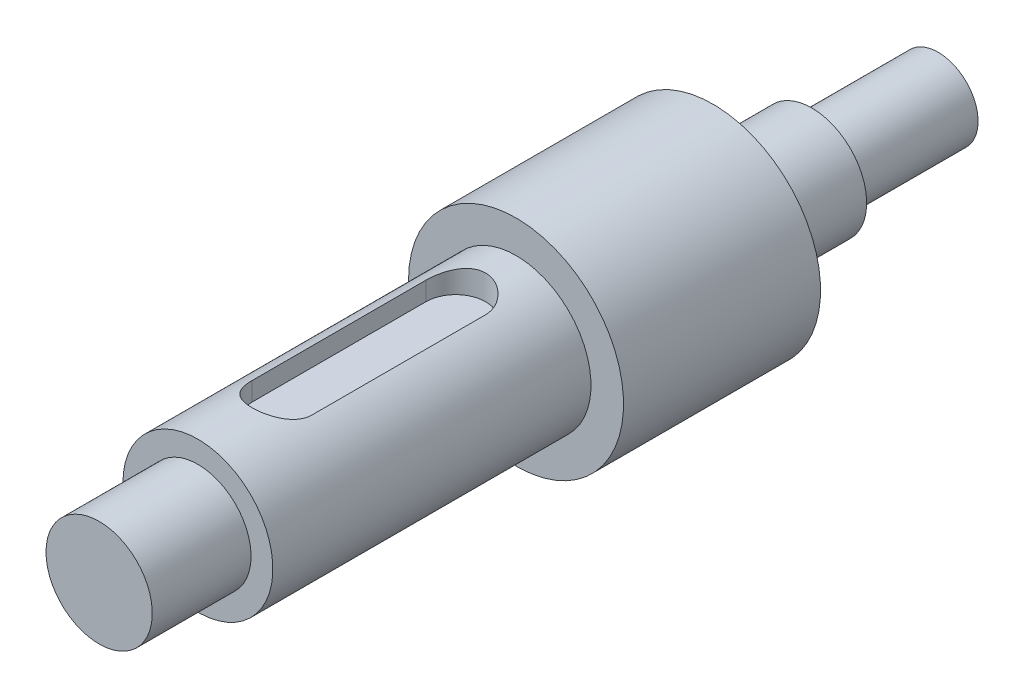
ISO-10303-21;
HEADER;
FILE_DESCRIPTION(('STEP AP214'),'2;1');
FILE_NAME('part.step','',(''),(''),'','','');
FILE_SCHEMA(('AUTOMOTIVE_DESIGN { 1 0 10303 214 1 1 1 1 }'));
ENDSEC;
DATA;
#1=APPLICATION_CONTEXT('core data for automotive mechanical design processes');
#2=APPLICATION_PROTOCOL_DEFINITION('international standard','automotive_design',2000,#1);
#3=PRODUCT_CONTEXT('',#1,'mechanical');
#4=PRODUCT('Part','Part','',(#3));
#5=PRODUCT_RELATED_PRODUCT_CATEGORY('part','',(#4));
#6=PRODUCT_DEFINITION_FORMATION('','',#4);
#7=PRODUCT_DEFINITION_CONTEXT('part definition',#1,'design');
#8=PRODUCT_DEFINITION('design','',#6,#7);
#9=PRODUCT_DEFINITION_SHAPE('','',#8);
#10=(LENGTH_UNIT() NAMED_UNIT(*) SI_UNIT(.MILLI.,.METRE.));
#11=(NAMED_UNIT(*) PLANE_ANGLE_UNIT() SI_UNIT($,.RADIAN.));
#12=(NAMED_UNIT(*) SI_UNIT($,.STERADIAN.) SOLID_ANGLE_UNIT());
#13=UNCERTAINTY_MEASURE_WITH_UNIT(LENGTH_MEASURE(1.E-05),#10,'distance_accuracy_value','');
#14=(GEOMETRIC_REPRESENTATION_CONTEXT(3) GLOBAL_UNCERTAINTY_ASSIGNED_CONTEXT((#13)) GLOBAL_UNIT_ASSIGNED_CONTEXT((#10,
#11,#12)) REPRESENTATION_CONTEXT('',''));
#15=CARTESIAN_POINT('',(0.,0.,0.));
#16=DIRECTION('',(0.,0.,1.));
#17=DIRECTION('',(1.,0.,0.));
#18=AXIS2_PLACEMENT_3D('',#15,#16,#17);
#19=CARTESIAN_POINT('',(0.318441737192823,0.,12.7486249221533));
#20=DIRECTION('',(0.,0.,-1.));
#21=DIRECTION('',(-1.,0.,0.));
#22=AXIS2_PLACEMENT_3D('',#19,#20,#21);
#23=CYLINDRICAL_SURFACE('',#22,15.0366592187236);
#24=CARTESIAN_POINT('',(0.318441737192834,0.,97.4337251720174));
#25=DIRECTION('',(0.,0.,-1.));
#26=DIRECTION('',(-1.,0.,0.));
#27=AXIS2_PLACEMENT_3D('',#24,#25,#26);
#28=CIRCLE('',#27,15.0366592187236);
#29=CARTESIAN_POINT('',(-14.7182174815307,0.,97.4337251720174));
#30=VERTEX_POINT('',#29);
#31=EDGE_CURVE('E135',#30,#30,#28,.T.);
#32=ORIENTED_EDGE('',*,*,#31,.F.);
#33=EDGE_LOOP('',(#32));
#34=FACE_BOUND('',#33,.T.);
#35=CARTESIAN_POINT('',(0.318441737192842,0.,161.246565548754));
#36=DIRECTION('',(0.,0.,-1.));
#37=DIRECTION('',(-1.,0.,0.));
#38=AXIS2_PLACEMENT_3D('',#35,#36,#37);
#39=CIRCLE('',#38,15.0366592187236);
#40=CARTESIAN_POINT('',(-14.7182174815307,0.,161.246565548754));
#41=VERTEX_POINT('',#40);
#42=EDGE_CURVE('E138',#41,#41,#39,.T.);
#43=ORIENTED_EDGE('',*,*,#42,.T.);
#44=EDGE_LOOP('',(#43));
#45=FACE_BOUND('',#44,.T.);
#46=CARTESIAN_POINT('',(-5.68155826280717,13.7877162887849,144.357474626036));
#47=CARTESIAN_POINT('',(-5.68158364196932,13.7876824521223,144.51892611595));
#48=CARTESIAN_POINT('',(-5.67504278508044,13.7905510297241,144.680363535283));
#49=CARTESIAN_POINT('',(-5.64901984383552,13.8018437562898,145.001936935393));
#50=CARTESIAN_POINT('',(-5.62954266444027,13.8102657995824,145.162073386162));
#51=CARTESIAN_POINT('',(-5.57793923631148,13.8323732041661,145.479273818918));
#52=CARTESIAN_POINT('',(-5.54586279071649,13.8460378373492,145.636347372829));
#53=CARTESIAN_POINT('',(-5.46939865567801,13.8781754177784,145.946967048685));
#54=CARTESIAN_POINT('',(-5.42501021988302,13.8966486565174,146.100512956174));
#55=CARTESIAN_POINT('',(-5.32440362144194,13.9378032924518,146.402870470218));
#56=CARTESIAN_POINT('',(-5.26820114831916,13.9604791037801,146.551688057404));
#57=CARTESIAN_POINT('',(-5.14441044294762,14.0093821871191,146.843929823604));
#58=CARTESIAN_POINT('',(-5.07681794500688,14.035610788965,146.987351957253));
#59=CARTESIAN_POINT('',(-4.85764368003457,14.1185593633906,147.408407767054));
#60=CARTESIAN_POINT('',(-4.6896578172697,14.1795452475711,147.67685269045));
#61=CARTESIAN_POINT('',(-4.30472805205413,14.3098074246518,148.196232569167));
#62=CARTESIAN_POINT('',(-4.08572219875536,14.3793480354272,148.445573436449));
#63=CARTESIAN_POINT('',(-3.72870552940757,14.4823045523554,148.790085942558));
#64=CARTESIAN_POINT('',(-3.6048652276027,14.5164178527008,148.900064476061));
#65=CARTESIAN_POINT('',(-3.34831721848029,14.5833309637889,149.109555256635));
#66=CARTESIAN_POINT('',(-3.21561259175814,14.6161312245761,149.209071109144));
#67=CARTESIAN_POINT('',(-2.93662048614499,14.6808380668653,149.400722283703));
#68=CARTESIAN_POINT('',(-2.79000264873134,14.7126571572931,149.492406373258));
#69=CARTESIAN_POINT('',(-2.488941898886,14.773059056885,149.66299204646));
#70=CARTESIAN_POINT('',(-2.33450198467842,14.8016430926676,149.741898479865));
#71=CARTESIAN_POINT('',(-2.01880248916894,14.8547644128957,149.88625489589));
#72=CARTESIAN_POINT('',(-1.85754372529781,14.8793021806819,149.951706485969));
#73=CARTESIAN_POINT('',(-1.5293639247136,14.9236102076832,150.068511669936));
#74=CARTESIAN_POINT('',(-1.36244324896449,14.943380770173,150.119866160666));
#75=CARTESIAN_POINT('',(-1.03239523787332,14.9767330419291,150.205799376241));
#76=CARTESIAN_POINT('',(-0.869472682531354,14.9905670602263,150.241067213199));
#77=CARTESIAN_POINT('',(-0.540908784706519,15.0129858643842,150.297955205904));
#78=CARTESIAN_POINT('',(-0.375267602679847,15.021570958906,150.319576164153));
#79=CARTESIAN_POINT('',(-0.0426129809814786,15.0332448720069,150.348927905821));
#80=CARTESIAN_POINT('',(0.124400057023608,15.0363352455379,150.356662618916));
#81=CARTESIAN_POINT('',(0.458496264747184,15.036934733427,150.358165190356));
#82=CARTESIAN_POINT('',(0.62557943181093,15.0344440428212,150.351933536771));
#83=CARTESIAN_POINT('',(0.949111846106508,15.0242499543801,150.326318098729));
#84=CARTESIAN_POINT('',(1.10563132282922,15.0168471578389,150.307692592626));
#85=CARTESIAN_POINT('',(1.41648460015445,14.997322503457,150.258243901739));
#86=CARTESIAN_POINT('',(1.57081767055788,14.9851991058575,150.227416736981));
#87=CARTESIAN_POINT('',(1.87614476071612,14.9565432967811,150.153871112093));
#88=CARTESIAN_POINT('',(2.02713990481404,14.9400123952049,150.11115672401));
#89=CARTESIAN_POINT('',(2.32493224199645,14.9029407927134,150.014198880808));
#90=CARTESIAN_POINT('',(2.47172781660631,14.882398569118,149.959951046949));
#91=CARTESIAN_POINT('',(2.76230127996954,14.8374725326407,149.839503479439));
#92=CARTESIAN_POINT('',(2.90600346031381,14.8130368520977,149.773140302213));
#93=CARTESIAN_POINT('',(3.18731593085213,14.7611375058503,149.629526531494));
#94=CARTESIAN_POINT('',(3.32492396601996,14.733672732192,149.552271951349));
#95=CARTESIAN_POINT('',(3.72740730371644,14.6477009391079,149.304999483841));
#96=CARTESIAN_POINT('',(3.98213038576209,14.5855860139165,149.11939421219));
#97=CARTESIAN_POINT('',(4.47449402672163,14.4532915376692,148.697866359065));
#98=CARTESIAN_POINT('',(4.70993289402528,14.3828502302141,148.459449473762));
#99=CARTESIAN_POINT('',(5.03113959977185,14.279507104844,148.074797995486));
#100=CARTESIAN_POINT('',(5.13294713584163,14.2454213449457,147.941967436962));
#101=CARTESIAN_POINT('',(5.32528130081196,14.1789636965285,147.667993283983));
#102=CARTESIAN_POINT('',(5.41581207310568,14.1465911810459,147.526852771072));
#103=CARTESIAN_POINT('',(5.58741554392676,14.0835947628059,147.232840749385));
#104=CARTESIAN_POINT('',(5.66813727979677,14.0530489287718,147.079747610465));
#105=CARTESIAN_POINT('',(5.81625381041527,13.995766739088,146.766632098536));
#106=CARTESIAN_POINT('',(5.88365434688632,13.969028743573,146.606612747286));
#107=CARTESIAN_POINT('',(6.0044419448066,13.9203006129765,146.280890902146));
#108=CARTESIAN_POINT('',(6.0578463646173,13.8983046028243,146.115195738857));
#109=CARTESIAN_POINT('',(6.15015309607031,13.8598249576439,145.779262096454));
#110=CARTESIAN_POINT('',(6.18906191136926,13.8433388508626,145.60902569166));
#111=CARTESIAN_POINT('',(6.25299888758266,13.816058769754,145.259483598489));
#112=CARTESIAN_POINT('',(6.27751061038367,13.8054771868616,145.080066274672));
#113=CARTESIAN_POINT('',(6.31024709439676,13.7912814507305,144.719597214031));
#114=CARTESIAN_POINT('',(6.31848211683138,13.7876629078624,144.538546579261));
#115=CARTESIAN_POINT('',(6.31844173719283,13.7877162887849,144.357474626036));
#116=B_SPLINE_CURVE_WITH_KNOTS('',3,(#46,#47,#48,#49,#50,#51,#52,#53,#54,#55,#56,#57,#58,#59,
#60,#61,#62,#63,#64,#65,#66,#67,#68,#69,#70,#71,#72,#73,#74,#75,#76,#77,#78,#79,#80,#81,#82,#83,
#84,#85,#86,#87,#88,#89,#90,#91,#92,#93,#94,#95,#96,#97,#98,#99,#100,#101,#102,#103,#104,#105,
#106,#107,#108,#109,#110,#111,#112,#113,#114,#115),.UNSPECIFIED.,.F.,.F.,(4,2,2,2,2,2,2,2,2,2,2,
2,2,2,2,2,2,2,2,2,2,2,2,2,2,2,2,2,2,2,2,2,2,2,4),(0.,0.484174469500361,0.968165463204514,
1.45026225595007,1.93238827973956,2.41387802060716,2.89554848718493,3.85882049462557,
4.8712806009621,5.37812329593836,5.88479075652377,6.41161862469686,6.93824606435887,
7.46481055091241,7.99134153025425,8.4925013296677,8.99363165572084,9.4946201442332,
9.99559112544465,10.4684275623508,10.9414183577265,11.414247326006,11.887256128215,
12.367194100789,12.847308206529,13.8069238291626,14.8292031277117,15.3411059746933,
15.8528201761762,16.3793929459702,16.9057382542567,17.4314276521987,17.9568809073485,
18.5001842239969,19.0431449198108),.UNSPECIFIED.);
#117=CARTESIAN_POINT('',(-5.68155826280717,13.7877162887849,144.357474626036));
#118=VERTEX_POINT('',#117);
#119=CARTESIAN_POINT('',(6.31844173719283,13.7877162887849,144.357474626036));
#120=VERTEX_POINT('',#119);
#121=EDGE_CURVE('E147',#118,#120,#116,.T.);
#122=ORIENTED_EDGE('',*,*,#121,.F.);
#123=DIRECTION('',(0.,0.,-1.));
#124=VECTOR('',#123,1.);
#125=CARTESIAN_POINT('',(-5.68155826280716,13.7877162887849,12.7486249221533));
#126=LINE('',#125,#124);
#127=CARTESIAN_POINT('',(-5.68155826280717,13.7877162887849,109.524491590633));
#128=VERTEX_POINT('',#127);
#129=EDGE_CURVE('E13',#128,#118,#126,.F.);
#130=ORIENTED_EDGE('',*,*,#129,.F.);
#131=CARTESIAN_POINT('',(6.31844173719283,13.7877162887849,109.524491590633));
#132=CARTESIAN_POINT('',(6.31846711635497,13.7876824521223,109.363040100719));
#133=CARTESIAN_POINT('',(6.31192625946609,13.7905510297241,109.201602681386));
#134=CARTESIAN_POINT('',(6.28590331822118,13.8018437562899,108.880029281277));
#135=CARTESIAN_POINT('',(6.26642613882593,13.8102657995824,108.719892830508));
#136=CARTESIAN_POINT('',(6.21482271069712,13.8323732041661,108.402692397752));
#137=CARTESIAN_POINT('',(6.18274626510213,13.8460378373492,108.245618843841));
#138=CARTESIAN_POINT('',(6.10628213006365,13.8781754177784,107.934999167984));
#139=CARTESIAN_POINT('',(6.06189369426866,13.8966486565174,107.781453260496));
#140=CARTESIAN_POINT('',(5.96128709582758,13.9378032924518,107.479095746451));
#141=CARTESIAN_POINT('',(5.90508462270481,13.9604791037801,107.330278159265));
#142=CARTESIAN_POINT('',(5.78129391733326,14.0093821871191,107.038036393065));
#143=CARTESIAN_POINT('',(5.71370141939253,14.035610788965,106.894614259417));
#144=CARTESIAN_POINT('',(5.49452715442022,14.1185593633906,106.473558449615));
#145=CARTESIAN_POINT('',(5.32654129165535,14.1795452475711,106.20511352622));
#146=CARTESIAN_POINT('',(4.94161152643978,14.3098074246518,105.685733647502));
#147=CARTESIAN_POINT('',(4.72260567314101,14.3793480354272,105.43639278022));
#148=CARTESIAN_POINT('',(4.36558900379321,14.4823045523554,105.091880274112));
#149=CARTESIAN_POINT('',(4.24174870198834,14.5164178527008,104.981901740608));
#150=CARTESIAN_POINT('',(3.98520069286593,14.5833309637889,104.772410960035));
#151=CARTESIAN_POINT('',(3.85249606614378,14.6161312245761,104.672895107525));
#152=CARTESIAN_POINT('',(3.57350396053063,14.6808380668653,104.481243932966));
#153=CARTESIAN_POINT('',(3.42688612311698,14.7126571572931,104.389559843411));
#154=CARTESIAN_POINT('',(3.12582537327165,14.773059056885,104.21897417021));
#155=CARTESIAN_POINT('',(2.97138545906406,14.8016430926676,104.140067736805));
#156=CARTESIAN_POINT('',(2.65568596355458,14.8547644128957,103.99571132078));
#157=CARTESIAN_POINT('',(2.49442719968345,14.8793021806819,103.930259730701));
#158=CARTESIAN_POINT('',(2.16624739909925,14.9236102076833,103.813454546734));
#159=CARTESIAN_POINT('',(1.99932672335014,14.943380770173,103.762100056003));
#160=CARTESIAN_POINT('',(1.66927871225897,14.9767330419291,103.676166840429));
#161=CARTESIAN_POINT('',(1.50635615691699,14.9905670602263,103.64089900347));
#162=CARTESIAN_POINT('',(1.17779225909215,15.0129858643842,103.584011010765));
#163=CARTESIAN_POINT('',(1.01215107706548,15.021570958906,103.562390052516));
#164=CARTESIAN_POINT('',(0.679496455367116,15.0332448720069,103.533038310849));
#165=CARTESIAN_POINT('',(0.512483417362028,15.0363352455379,103.525303597754));
#166=CARTESIAN_POINT('',(0.178387209638451,15.0369347334269,103.523801026313));
#167=CARTESIAN_POINT('',(0.0113040425747041,15.0344440428212,103.530032679899));
#168=CARTESIAN_POINT('',(-0.312228371720872,15.0242499543801,103.55564811794));
#169=CARTESIAN_POINT('',(-0.46874784844358,15.0168471578389,103.574273624043));
#170=CARTESIAN_POINT('',(-0.779601125768814,14.997322503457,103.623722314931));
#171=CARTESIAN_POINT('',(-0.933934196172241,14.9851991058575,103.654549479688));
#172=CARTESIAN_POINT('',(-1.23926128633049,14.9565432967811,103.728095104576));
#173=CARTESIAN_POINT('',(-1.39025643042841,14.9400123952049,103.77080949266));
#174=CARTESIAN_POINT('',(-1.68804876761082,14.9029407927134,103.867767335861));
#175=CARTESIAN_POINT('',(-1.83484434222067,14.882398569118,103.92201516972));
#176=CARTESIAN_POINT('',(-2.12541780558391,14.8374725326407,104.042462737231));
#177=CARTESIAN_POINT('',(-2.26911998592817,14.8130368520977,104.108825914457));
#178=CARTESIAN_POINT('',(-2.5504324564665,14.7611375058503,104.252439685176));
#179=CARTESIAN_POINT('',(-2.68804049163433,14.733672732192,104.32969426532));
#180=CARTESIAN_POINT('',(-3.09052382933081,14.6477009391079,104.576966732828));
#181=CARTESIAN_POINT('',(-3.34524691137646,14.5855860139165,104.76257200448));
#182=CARTESIAN_POINT('',(-3.837610552336,14.4532915376692,105.184099857605));
#183=CARTESIAN_POINT('',(-4.07304941963964,14.3828502302141,105.422516742907));
#184=CARTESIAN_POINT('',(-4.39425612538621,14.279507104844,105.807168221184));
#185=CARTESIAN_POINT('',(-4.496063661456,14.2454213449457,105.939998779708));
#186=CARTESIAN_POINT('',(-4.68839782642632,14.1789636965285,106.213972932686));
#187=CARTESIAN_POINT('',(-4.77892859872005,14.1465911810459,106.355113445597));
#188=CARTESIAN_POINT('',(-4.95053206954112,14.0835947628059,106.649125467285));
#189=CARTESIAN_POINT('',(-5.03125380541113,14.0530489287718,106.802218606205));
#190=CARTESIAN_POINT('',(-5.17937033602963,13.995766739088,107.115334118134));
#191=CARTESIAN_POINT('',(-5.24677087250068,13.9690287435729,107.275353469384));
#192=CARTESIAN_POINT('',(-5.36755847042097,13.9203006129765,107.601075314523));
#193=CARTESIAN_POINT('',(-5.42096289023166,13.8983046028243,107.766770477813));
#194=CARTESIAN_POINT('',(-5.51326962168466,13.8598249576438,108.102704120215));
#195=CARTESIAN_POINT('',(-5.55217843698362,13.8433388508625,108.272940525009));
#196=CARTESIAN_POINT('',(-5.61611541319701,13.816058769754,108.62248261818));
#197=CARTESIAN_POINT('',(-5.64062713599802,13.8054771868616,108.801899941997));
#198=CARTESIAN_POINT('',(-5.67336362001111,13.7912814507305,109.162369002639));
#199=CARTESIAN_POINT('',(-5.68159864244572,13.7876629078624,109.343419637409));
#200=CARTESIAN_POINT('',(-5.68155826280717,13.7877162887849,109.524491590633));
#201=B_SPLINE_CURVE_WITH_KNOTS('',3,(#131,#132,#133,#134,#135,#136,#137,#138,#139,#140,#141,
#142,#143,#144,#145,#146,#147,#148,#149,#150,#151,#152,#153,#154,#155,#156,#157,#158,#159,#160,
#161,#162,#163,#164,#165,#166,#167,#168,#169,#170,#171,#172,#173,#174,#175,#176,#177,#178,#179,
#180,#181,#182,#183,#184,#185,#186,#187,#188,#189,#190,#191,#192,#193,#194,#195,#196,#197,#198,
#199,#200),.UNSPECIFIED.,.F.,.F.,(4,2,2,2,2,2,2,2,2,2,2,2,2,2,2,2,2,2,2,2,2,2,2,2,2,2,2,2,2,2,2,
2,2,2,4),(0.,0.484174469500348,0.968165463204542,1.4502622559501,1.93238827973957,
2.41387802060714,2.89554848718494,3.85882049462556,4.87128060096209,5.37812329593836,
5.88479075652374,6.41161862469682,6.93824606435886,7.46481055091237,7.99134153025423,
8.49250132966768,8.99363165572082,9.49462014423317,9.99559112544463,10.4684275623507,
10.9414183577265,11.4142473260059,11.8872561282149,12.367194100789,12.847308206529,
13.8069238291625,14.8292031277117,15.3411059746933,15.8528201761761,16.3793929459702,
16.9057382542568,17.4314276521987,17.9568809073485,18.5001842239968,19.0431449198107),.UNSPECIFIED.);
#202=CARTESIAN_POINT('',(6.31844173719283,13.7877162887849,109.524491590633));
#203=VERTEX_POINT('',#202);
#204=EDGE_CURVE('E60',#203,#128,#201,.T.);
#205=ORIENTED_EDGE('',*,*,#204,.F.);
#206=DIRECTION('',(0.,0.,-1.));
#207=VECTOR('',#206,1.);
#208=CARTESIAN_POINT('',(6.31844173719284,13.7877162887849,12.7486249221533));
#209=LINE('',#208,#207);
#210=EDGE_CURVE('E110',#120,#203,#209,.T.);
#211=ORIENTED_EDGE('',*,*,#210,.F.);
#212=EDGE_LOOP('',(#122,#130,#205,#211));
#213=FACE_BOUND('',#212,.T.);
#214=ADVANCED_FACE('F52',(#34,#45,#213),#23,.T.);
#215=CARTESIAN_POINT('',(8.31737198154503,0.,12.7486249221533));
#216=DIRECTION('',(0.,0.,1.));
#217=DIRECTION('',(1.,0.,0.));
#218=AXIS2_PLACEMENT_3D('',#215,#216,#217);
#219=PLANE('',#218);
#220=CARTESIAN_POINT('',(0.318441737192823,0.,12.7486249221533));
#221=DIRECTION('',(0.,0.,-1.));
#222=DIRECTION('',(-1.,0.,0.));
#223=AXIS2_PLACEMENT_3D('',#220,#221,#222);
#224=CIRCLE('',#223,7.99893024435221);
#225=CARTESIAN_POINT('',(-7.68048850715939,0.,12.7486249221533));
#226=VERTEX_POINT('',#225);
#227=EDGE_CURVE('E111',#226,#226,#224,.T.);
#228=ORIENTED_EDGE('',*,*,#227,.T.);
#229=EDGE_LOOP('',(#228));
#230=FACE_BOUND('',#229,.T.);
#231=ADVANCED_FACE('F54',(#230),#219,.F.);
#232=CARTESIAN_POINT('',(10.9780958476107,0.,181.058565548754));
#233=DIRECTION('',(0.,0.,-1.));
#234=DIRECTION('',(-1.,0.,0.));
#235=AXIS2_PLACEMENT_3D('',#232,#233,#234);
#236=PLANE('',#235);
#237=CARTESIAN_POINT('',(0.318441737192844,0.,181.058565548754));
#238=DIRECTION('',(0.,0.,-1.));
#239=DIRECTION('',(-1.,0.,0.));
#240=AXIS2_PLACEMENT_3D('',#237,#238,#239);
#241=CIRCLE('',#240,10.6596541104178);
#242=CARTESIAN_POINT('',(-10.341212373225,0.,181.058565548754));
#243=VERTEX_POINT('',#242);
#244=EDGE_CURVE('E144',#243,#243,#241,.T.);
#245=ORIENTED_EDGE('',*,*,#244,.F.);
#246=EDGE_LOOP('',(#245));
#247=FACE_BOUND('',#246,.T.);
#248=ADVANCED_FACE('F192',(#247),#236,.F.);
#249=CARTESIAN_POINT('',(0.318441737192823,0.,12.7486249221533));
#250=DIRECTION('',(0.,0.,-1.));
#251=DIRECTION('',(-1.,0.,0.));
#252=AXIS2_PLACEMENT_3D('',#249,#250,#251);
#253=CYLINDRICAL_SURFACE('',#252,10.6596541104178);
#254=CARTESIAN_POINT('',(0.318441737192842,0.,161.246565548754));
#255=DIRECTION('',(0.,0.,-1.));
#256=DIRECTION('',(-1.,0.,0.));
#257=AXIS2_PLACEMENT_3D('',#254,#255,#256);
#258=CIRCLE('',#257,10.6596541104178);
#259=CARTESIAN_POINT('',(-10.341212373225,0.,161.246565548754));
#260=VERTEX_POINT('',#259);
#261=EDGE_CURVE('E141',#260,#260,#258,.T.);
#262=ORIENTED_EDGE('',*,*,#261,.F.);
#263=EDGE_LOOP('',(#262));
#264=FACE_BOUND('',#263,.T.);
#265=ORIENTED_EDGE('',*,*,#244,.T.);
#266=EDGE_LOOP('',(#265));
#267=FACE_BOUND('',#266,.T.);
#268=ADVANCED_FACE('F202',(#264,#267),#253,.T.);
#269=CARTESIAN_POINT('',(15.3551009559164,0.,161.246565548754));
#270=DIRECTION('',(0.,0.,-1.));
#271=DIRECTION('',(-1.,0.,0.));
#272=AXIS2_PLACEMENT_3D('',#269,#270,#271);
#273=PLANE('',#272);
#274=ORIENTED_EDGE('',*,*,#42,.F.);
#275=EDGE_LOOP('',(#274));
#276=FACE_BOUND('',#275,.T.);
#277=ORIENTED_EDGE('',*,*,#261,.T.);
#278=EDGE_LOOP('',(#277));
#279=FACE_BOUND('',#278,.T.);
#280=ADVANCED_FACE('F198',(#276,#279),#273,.F.);
#281=CARTESIAN_POINT('',(21.8850177039165,0.,97.4337251720174));
#282=DIRECTION('',(0.,0.,-1.));
#283=DIRECTION('',(-1.,0.,0.));
#284=AXIS2_PLACEMENT_3D('',#281,#282,#283);
#285=PLANE('',#284);
#286=CARTESIAN_POINT('',(0.318441737192834,0.,97.4337251720174));
#287=DIRECTION('',(0.,0.,-1.));
#288=DIRECTION('',(-1.,0.,0.));
#289=AXIS2_PLACEMENT_3D('',#286,#287,#288);
#290=CIRCLE('',#289,21.5665759667237);
#291=CARTESIAN_POINT('',(-21.2481342295309,0.,97.4337251720174));
#292=VERTEX_POINT('',#291);
#293=EDGE_CURVE('E132',#292,#292,#290,.T.);
#294=ORIENTED_EDGE('',*,*,#293,.F.);
#295=EDGE_LOOP('',(#294));
#296=FACE_BOUND('',#295,.T.);
#297=ORIENTED_EDGE('',*,*,#31,.T.);
#298=EDGE_LOOP('',(#297));
#299=FACE_BOUND('',#298,.T.);
#300=ADVANCED_FACE('F201',(#296,#299),#285,.F.);
#301=CARTESIAN_POINT('',(0.318441737192823,0.,12.7486249221533));
#302=DIRECTION('',(0.,0.,-1.));
#303=DIRECTION('',(-1.,0.,0.));
#304=AXIS2_PLACEMENT_3D('',#301,#302,#303);
#305=CYLINDRICAL_SURFACE('',#304,21.5665759667237);
#306=CARTESIAN_POINT('',(0.318441737192829,0.,57.912));
#307=DIRECTION('',(0.,0.,-1.));
#308=DIRECTION('',(-1.,0.,0.));
#309=AXIS2_PLACEMENT_3D('',#306,#307,#308);
#310=CIRCLE('',#309,21.5665759667237);
#311=CARTESIAN_POINT('',(-21.2481342295309,0.,57.912));
#312=VERTEX_POINT('',#311);
#313=EDGE_CURVE('E129',#312,#312,#310,.T.);
#314=ORIENTED_EDGE('',*,*,#313,.F.);
#315=EDGE_LOOP('',(#314));
#316=FACE_BOUND('',#315,.T.);
#317=ORIENTED_EDGE('',*,*,#293,.T.);
#318=EDGE_LOOP('',(#317));
#319=FACE_BOUND('',#318,.T.);
#320=ADVANCED_FACE('F229',(#316,#319),#305,.T.);
#321=CARTESIAN_POINT('',(11.317371981545,0.,57.912));
#322=DIRECTION('',(0.,0.,1.));
#323=DIRECTION('',(1.,0.,0.));
#324=AXIS2_PLACEMENT_3D('',#321,#322,#323);
#325=PLANE('',#324);
#326=CARTESIAN_POINT('',(0.318441737192829,0.,57.912));
#327=DIRECTION('',(0.,0.,-1.));
#328=DIRECTION('',(-1.,0.,0.));
#329=AXIS2_PLACEMENT_3D('',#326,#327,#328);
#330=CIRCLE('',#329,10.9989302443522);
#331=CARTESIAN_POINT('',(-10.6804885071594,0.,57.912));
#332=VERTEX_POINT('',#331);
#333=EDGE_CURVE('E126',#332,#332,#330,.T.);
#334=ORIENTED_EDGE('',*,*,#333,.F.);
#335=EDGE_LOOP('',(#334));
#336=FACE_BOUND('',#335,.T.);
#337=ORIENTED_EDGE('',*,*,#313,.T.);
#338=EDGE_LOOP('',(#337));
#339=FACE_BOUND('',#338,.T.);
#340=ADVANCED_FACE('F236',(#336,#339),#325,.F.);
#341=CARTESIAN_POINT('',(0.318441737192823,0.,12.7486249221533));
#342=DIRECTION('',(0.,0.,-1.));
#343=DIRECTION('',(-1.,0.,0.));
#344=AXIS2_PLACEMENT_3D('',#341,#342,#343);
#345=CYLINDRICAL_SURFACE('',#344,10.9989302443522);
#346=CARTESIAN_POINT('',(0.318441737192826,0.,38.1));
#347=DIRECTION('',(0.,0.,-1.));
#348=DIRECTION('',(-1.,0.,0.));
#349=AXIS2_PLACEMENT_3D('',#346,#347,#348);
#350=CIRCLE('',#349,10.9989302443522);
#351=CARTESIAN_POINT('',(-10.6804885071594,0.,38.1));
#352=VERTEX_POINT('',#351);
#353=EDGE_CURVE('E123',#352,#352,#350,.T.);
#354=ORIENTED_EDGE('',*,*,#353,.F.);
#355=EDGE_LOOP('',(#354));
#356=FACE_BOUND('',#355,.T.);
#357=ORIENTED_EDGE('',*,*,#333,.T.);
#358=EDGE_LOOP('',(#357));
#359=FACE_BOUND('',#358,.T.);
#360=ADVANCED_FACE('F244',(#356,#359),#345,.T.);
#361=CARTESIAN_POINT('',(8.31737198154504,0.,38.1));
#362=DIRECTION('',(0.,0.,1.));
#363=DIRECTION('',(1.,0.,0.));
#364=AXIS2_PLACEMENT_3D('',#361,#362,#363);
#365=PLANE('',#364);
#366=CARTESIAN_POINT('',(0.318441737192826,0.,38.1));
#367=DIRECTION('',(0.,0.,-1.));
#368=DIRECTION('',(-1.,0.,0.));
#369=AXIS2_PLACEMENT_3D('',#366,#367,#368);
#370=CIRCLE('',#369,7.99893024435221);
#371=CARTESIAN_POINT('',(-7.68048850715938,0.,38.1));
#372=VERTEX_POINT('',#371);
#373=EDGE_CURVE('E115',#372,#372,#370,.T.);
#374=ORIENTED_EDGE('',*,*,#373,.F.);
#375=EDGE_LOOP('',(#374));
#376=FACE_BOUND('',#375,.T.);
#377=ORIENTED_EDGE('',*,*,#353,.T.);
#378=EDGE_LOOP('',(#377));
#379=FACE_BOUND('',#378,.T.);
#380=ADVANCED_FACE('F252',(#376,#379),#365,.F.);
#381=CARTESIAN_POINT('',(0.318441737192823,0.,12.7486249221533));
#382=DIRECTION('',(0.,0.,-1.));
#383=DIRECTION('',(-1.,0.,0.));
#384=AXIS2_PLACEMENT_3D('',#381,#382,#383);
#385=CYLINDRICAL_SURFACE('',#384,7.99893024435221);
#386=ORIENTED_EDGE('',*,*,#227,.F.);
#387=EDGE_LOOP('',(#386));
#388=FACE_BOUND('',#387,.T.);
#389=ORIENTED_EDGE('',*,*,#373,.T.);
#390=EDGE_LOOP('',(#389));
#391=FACE_BOUND('',#390,.T.);
#392=ADVANCED_FACE('F171',(#388,#391),#385,.T.);
#393=CARTESIAN_POINT('',(0.318441737192829,10.0366592187235,109.524491590633));
#394=DIRECTION('',(0.,1.,0.));
#395=DIRECTION('',(0.,0.,1.));
#396=AXIS2_PLACEMENT_3D('',#393,#394,#395);
#397=CYLINDRICAL_SURFACE('',#396,6.);
#398=DIRECTION('',(0.,1.,0.));
#399=VECTOR('',#398,1.);
#400=CARTESIAN_POINT('',(6.31844173719283,10.0366592187235,109.524491590633));
#401=LINE('',#400,#399);
#402=CARTESIAN_POINT('',(6.31844173719283,10.0366592187235,109.524491590633));
#403=VERTEX_POINT('',#402);
#404=EDGE_CURVE('E107',#403,#203,#401,.T.);
#405=ORIENTED_EDGE('',*,*,#404,.T.);
#406=ORIENTED_EDGE('',*,*,#204,.T.);
#407=DIRECTION('',(0.,1.,0.));
#408=VECTOR('',#407,1.);
#409=CARTESIAN_POINT('',(-5.68155826280717,10.0366592187235,109.524491590633));
#410=LINE('',#409,#408);
#411=CARTESIAN_POINT('',(-5.68155826280717,10.0366592187235,109.524491590633));
#412=VERTEX_POINT('',#411);
#413=EDGE_CURVE('E66',#412,#128,#410,.T.);
#414=ORIENTED_EDGE('',*,*,#413,.F.);
#415=CARTESIAN_POINT('',(0.318441737192829,10.0366592187235,109.524491590633));
#416=DIRECTION('',(0.,-1.,0.));
#417=DIRECTION('',(0.,0.,1.));
#418=AXIS2_PLACEMENT_3D('',#415,#416,#417);
#419=CIRCLE('',#418,6.);
#420=EDGE_CURVE('E97',#412,#403,#419,.T.);
#421=ORIENTED_EDGE('',*,*,#420,.T.);
#422=EDGE_LOOP('',(#405,#406,#414,#421));
#423=FACE_BOUND('',#422,.T.);
#424=ADVANCED_FACE('F106',(#423),#397,.F.);
#425=CARTESIAN_POINT('',(6.31844173719283,10.0366592187235,109.524491590633));
#426=DIRECTION('',(-1.,0.,0.));
#427=DIRECTION('',(0.,0.,1.));
#428=AXIS2_PLACEMENT_3D('',#425,#426,#427);
#429=PLANE('',#428);
#430=ORIENTED_EDGE('',*,*,#210,.T.);
#431=ORIENTED_EDGE('',*,*,#404,.F.);
#432=DIRECTION('',(0.,0.,1.));
#433=VECTOR('',#432,1.);
#434=CARTESIAN_POINT('',(6.31844173719283,10.0366592187235,109.524491590633));
#435=LINE('',#434,#433);
#436=CARTESIAN_POINT('',(6.31844173719283,10.0366592187232,144.357474626036));
#437=VERTEX_POINT('',#436);
#438=EDGE_CURVE('E93',#403,#437,#435,.T.);
#439=ORIENTED_EDGE('',*,*,#438,.T.);
#440=DIRECTION('',(0.,1.,0.));
#441=VECTOR('',#440,1.);
#442=CARTESIAN_POINT('',(6.31844173719283,10.0366592187232,144.357474626036));
#443=LINE('',#442,#441);
#444=EDGE_CURVE('E112',#437,#120,#443,.T.);
#445=ORIENTED_EDGE('',*,*,#444,.T.);
#446=EDGE_LOOP('',(#430,#431,#439,#445));
#447=FACE_BOUND('',#446,.T.);
#448=ADVANCED_FACE('F109',(#447),#429,.T.);
#449=CARTESIAN_POINT('',(0.318441737192826,10.0366592187232,144.357474626036));
#450=DIRECTION('',(0.,1.,0.));
#451=DIRECTION('',(0.,0.,1.));
#452=AXIS2_PLACEMENT_3D('',#449,#450,#451);
#453=CYLINDRICAL_SURFACE('',#452,6.);
#454=DIRECTION('',(0.,1.,0.));
#455=VECTOR('',#454,1.);
#456=CARTESIAN_POINT('',(-5.68155826280717,10.0366592187232,144.357474626036));
#457=LINE('',#456,#455);
#458=CARTESIAN_POINT('',(-5.68155826280717,10.0366592187232,144.357474626036));
#459=VERTEX_POINT('',#458);
#460=EDGE_CURVE('E117',#459,#118,#457,.T.);
#461=ORIENTED_EDGE('',*,*,#460,.T.);
#462=ORIENTED_EDGE('',*,*,#121,.T.);
#463=ORIENTED_EDGE('',*,*,#444,.F.);
#464=CARTESIAN_POINT('',(0.318441737192826,10.0366592187232,144.357474626036));
#465=DIRECTION('',(0.,-1.,0.));
#466=DIRECTION('',(0.,0.,-1.));
#467=AXIS2_PLACEMENT_3D('',#464,#465,#466);
#468=CIRCLE('',#467,6.);
#469=EDGE_CURVE('E98',#437,#459,#468,.T.);
#470=ORIENTED_EDGE('',*,*,#469,.T.);
#471=EDGE_LOOP('',(#461,#462,#463,#470));
#472=FACE_BOUND('',#471,.T.);
#473=ADVANCED_FACE('F158',(#472),#453,.F.);
#474=CARTESIAN_POINT('',(-5.68155826280717,10.0366592187235,109.524491590633));
#475=DIRECTION('',(1.,0.,0.));
#476=DIRECTION('',(0.,0.,-1.));
#477=AXIS2_PLACEMENT_3D('',#474,#475,#476);
#478=PLANE('',#477);
#479=ORIENTED_EDGE('',*,*,#129,.T.);
#480=ORIENTED_EDGE('',*,*,#460,.F.);
#481=DIRECTION('',(0.,0.,-1.));
#482=VECTOR('',#481,1.);
#483=CARTESIAN_POINT('',(-5.68155826280717,10.0366592187235,109.524491590633));
#484=LINE('',#483,#482);
#485=EDGE_CURVE('E179',#459,#412,#484,.T.);
#486=ORIENTED_EDGE('',*,*,#485,.T.);
#487=ORIENTED_EDGE('',*,*,#413,.T.);
#488=EDGE_LOOP('',(#479,#480,#486,#487));
#489=FACE_BOUND('',#488,.T.);
#490=ADVANCED_FACE('F163',(#489),#478,.T.);
#491=CARTESIAN_POINT('',(0.318441737192829,10.0366592187235,109.524491590633));
#492=DIRECTION('',(0.,1.,0.));
#493=DIRECTION('',(0.,0.,1.));
#494=AXIS2_PLACEMENT_3D('',#491,#492,#493);
#495=PLANE('',#494);
#496=ORIENTED_EDGE('',*,*,#420,.F.);
#497=ORIENTED_EDGE('',*,*,#485,.F.);
#498=ORIENTED_EDGE('',*,*,#469,.F.);
#499=ORIENTED_EDGE('',*,*,#438,.F.);
#500=EDGE_LOOP('',(#496,#497,#498,#499));
#501=FACE_BOUND('',#500,.T.);
#502=ADVANCED_FACE('F95',(#501),#495,.T.);
#503=CLOSED_SHELL('',(#214,#231,#248,#268,#280,#300,#320,#340,#360,#380,#392,#424,#448,#473,
#490,#502));
#504=MANIFOLD_SOLID_BREP('B2',#503);
#505=ADVANCED_BREP_SHAPE_REPRESENTATION('',(#18,#504),#14);
#506=SHAPE_DEFINITION_REPRESENTATION(#9,#505);
ENDSEC;
END-ISO-10303-21;
